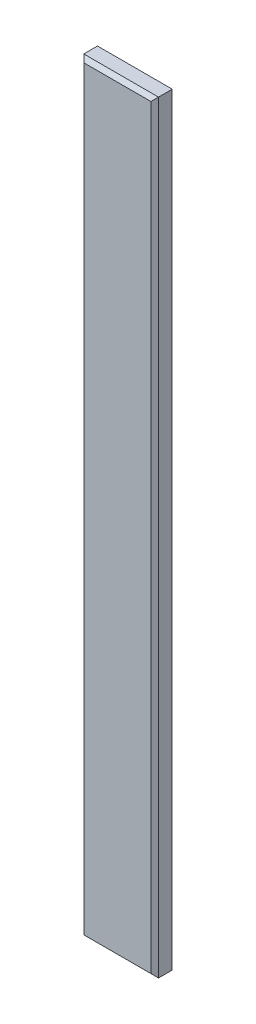
ISO-10303-21;
HEADER;
FILE_DESCRIPTION(('STEP AP214'),'2;1');
FILE_NAME('part.step','',(''),(''),'','','');
FILE_SCHEMA(('AUTOMOTIVE_DESIGN { 1 0 10303 214 1 1 1 1 }'));
ENDSEC;
DATA;
#1=APPLICATION_CONTEXT('core data for automotive mechanical design processes');
#2=APPLICATION_PROTOCOL_DEFINITION('international standard','automotive_design',2000,#1);
#3=PRODUCT_CONTEXT('',#1,'mechanical');
#4=PRODUCT('Part','Part','',(#3));
#5=PRODUCT_RELATED_PRODUCT_CATEGORY('part','',(#4));
#6=PRODUCT_DEFINITION_FORMATION('','',#4);
#7=PRODUCT_DEFINITION_CONTEXT('part definition',#1,'design');
#8=PRODUCT_DEFINITION('design','',#6,#7);
#9=PRODUCT_DEFINITION_SHAPE('','',#8);
#10=(LENGTH_UNIT() NAMED_UNIT(*) SI_UNIT(.MILLI.,.METRE.));
#11=(NAMED_UNIT(*) PLANE_ANGLE_UNIT() SI_UNIT($,.RADIAN.));
#12=(NAMED_UNIT(*) SI_UNIT($,.STERADIAN.) SOLID_ANGLE_UNIT());
#13=UNCERTAINTY_MEASURE_WITH_UNIT(LENGTH_MEASURE(1.E-05),#10,'distance_accuracy_value','');
#14=(GEOMETRIC_REPRESENTATION_CONTEXT(3) GLOBAL_UNCERTAINTY_ASSIGNED_CONTEXT((#13)) GLOBAL_UNIT_ASSIGNED_CONTEXT((#10,
#11,#12)) REPRESENTATION_CONTEXT('',''));
#15=CARTESIAN_POINT('',(0.,0.,0.));
#16=DIRECTION('',(0.,0.,1.));
#17=DIRECTION('',(1.,0.,0.));
#18=AXIS2_PLACEMENT_3D('',#15,#16,#17);
#19=CARTESIAN_POINT('',(4.9,100.,-1.4));
#20=DIRECTION('',(-1.,0.,0.));
#21=DIRECTION('',(0.,0.,1.));
#22=AXIS2_PLACEMENT_3D('',#19,#20,#21);
#23=PLANE('',#22);
#24=DIRECTION('',(0.,0.,-1.));
#25=VECTOR('',#24,1.);
#26=CARTESIAN_POINT('',(4.9,100.,-1.4));
#27=LINE('',#26,#25);
#28=CARTESIAN_POINT('',(4.9,100.,0.9));
#29=VERTEX_POINT('',#28);
#30=CARTESIAN_POINT('',(4.9,100.,-0.899999999999999));
#31=VERTEX_POINT('',#30);
#32=EDGE_CURVE('E183',#29,#31,#27,.T.);
#33=ORIENTED_EDGE('',*,*,#32,.F.);
#34=DIRECTION('',(0.,-1.,0.));
#35=VECTOR('',#34,1.);
#36=CARTESIAN_POINT('',(4.9,100.,0.9));
#37=LINE('',#36,#35);
#38=CARTESIAN_POINT('',(4.9,0.,0.9));
#39=VERTEX_POINT('',#38);
#40=EDGE_CURVE('E141',#29,#39,#37,.T.);
#41=ORIENTED_EDGE('',*,*,#40,.T.);
#42=DIRECTION('',(0.,0.,-1.));
#43=VECTOR('',#42,1.);
#44=CARTESIAN_POINT('',(4.9,0.,-1.4));
#45=LINE('',#44,#43);
#46=CARTESIAN_POINT('',(4.9,0.,-0.899999999999999));
#47=VERTEX_POINT('',#46);
#48=EDGE_CURVE('E156',#39,#47,#45,.T.);
#49=ORIENTED_EDGE('',*,*,#48,.T.);
#50=DIRECTION('',(0.,1.,0.));
#51=VECTOR('',#50,1.);
#52=CARTESIAN_POINT('',(4.9,100.,-0.899999999999999));
#53=LINE('',#52,#51);
#54=EDGE_CURVE('E138',#47,#31,#53,.T.);
#55=ORIENTED_EDGE('',*,*,#54,.T.);
#56=EDGE_LOOP('',(#33,#41,#49,#55));
#57=FACE_BOUND('',#56,.T.);
#58=ADVANCED_FACE('F35',(#57),#23,.F.);
#59=CARTESIAN_POINT('',(-4.9,100.,-1.4));
#60=DIRECTION('',(0.,0.,1.));
#61=DIRECTION('',(1.,0.,0.));
#62=AXIS2_PLACEMENT_3D('',#59,#60,#61);
#63=PLANE('',#62);
#64=DIRECTION('',(1.,0.,0.));
#65=VECTOR('',#64,1.);
#66=CARTESIAN_POINT('',(4.9,99.5,-1.4));
#67=LINE('',#66,#65);
#68=CARTESIAN_POINT('',(-4.40000000000001,99.5,-1.4));
#69=VERTEX_POINT('',#68);
#70=CARTESIAN_POINT('',(4.40000000000002,99.5,-1.4));
#71=VERTEX_POINT('',#70);
#72=EDGE_CURVE('E45',#69,#71,#67,.T.);
#73=ORIENTED_EDGE('',*,*,#72,.T.);
#74=DIRECTION('',(0.,-1.,0.));
#75=VECTOR('',#74,1.);
#76=CARTESIAN_POINT('',(4.40000000000002,100.,-1.4));
#77=LINE('',#76,#75);
#78=CARTESIAN_POINT('',(4.40000000000002,0.499999999999987,-1.4));
#79=VERTEX_POINT('',#78);
#80=EDGE_CURVE('E11',#71,#79,#77,.T.);
#81=ORIENTED_EDGE('',*,*,#80,.T.);
#82=DIRECTION('',(-1.,0.,0.));
#83=VECTOR('',#82,1.);
#84=CARTESIAN_POINT('',(-4.9,0.499999999999987,-1.4));
#85=LINE('',#84,#83);
#86=CARTESIAN_POINT('',(-4.40000000000001,0.499999999999987,-1.4));
#87=VERTEX_POINT('',#86);
#88=EDGE_CURVE('E147',#79,#87,#85,.T.);
#89=ORIENTED_EDGE('',*,*,#88,.T.);
#90=DIRECTION('',(0.,1.,0.));
#91=VECTOR('',#90,1.);
#92=CARTESIAN_POINT('',(-4.40000000000001,100.,-1.4));
#93=LINE('',#92,#91);
#94=EDGE_CURVE('E56',#87,#69,#93,.T.);
#95=ORIENTED_EDGE('',*,*,#94,.T.);
#96=EDGE_LOOP('',(#73,#81,#89,#95));
#97=FACE_BOUND('',#96,.T.);
#98=ADVANCED_FACE('F206',(#97),#63,.F.);
#99=CARTESIAN_POINT('',(-4.9,100.,-1.4));
#100=DIRECTION('',(1.,0.,0.));
#101=DIRECTION('',(0.,0.,-1.));
#102=AXIS2_PLACEMENT_3D('',#99,#100,#101);
#103=PLANE('',#102);
#104=DIRECTION('',(0.,0.,1.));
#105=VECTOR('',#104,1.);
#106=CARTESIAN_POINT('',(-4.9,0.,-1.4));
#107=LINE('',#106,#105);
#108=CARTESIAN_POINT('',(-4.9,0.,-0.899999999999999));
#109=VERTEX_POINT('',#108);
#110=CARTESIAN_POINT('',(-4.9,0.,0.9));
#111=VERTEX_POINT('',#110);
#112=EDGE_CURVE('E177',#109,#111,#107,.T.);
#113=ORIENTED_EDGE('',*,*,#112,.T.);
#114=DIRECTION('',(0.,1.,0.));
#115=VECTOR('',#114,1.);
#116=CARTESIAN_POINT('',(-4.9,100.,0.9));
#117=LINE('',#116,#115);
#118=CARTESIAN_POINT('',(-4.9,100.,0.9));
#119=VERTEX_POINT('',#118);
#120=EDGE_CURVE('E108',#111,#119,#117,.T.);
#121=ORIENTED_EDGE('',*,*,#120,.T.);
#122=DIRECTION('',(0.,0.,1.));
#123=VECTOR('',#122,1.);
#124=CARTESIAN_POINT('',(-4.9,100.,-1.4));
#125=LINE('',#124,#123);
#126=CARTESIAN_POINT('',(-4.9,100.,-0.899999999999999));
#127=VERTEX_POINT('',#126);
#128=EDGE_CURVE('E121',#127,#119,#125,.T.);
#129=ORIENTED_EDGE('',*,*,#128,.F.);
#130=DIRECTION('',(0.,-1.,0.));
#131=VECTOR('',#130,1.);
#132=CARTESIAN_POINT('',(-4.9,100.,-0.899999999999999));
#133=LINE('',#132,#131);
#134=EDGE_CURVE('E127',#127,#109,#133,.T.);
#135=ORIENTED_EDGE('',*,*,#134,.T.);
#136=EDGE_LOOP('',(#113,#121,#129,#135));
#137=FACE_BOUND('',#136,.T.);
#138=ADVANCED_FACE('F176',(#137),#103,.F.);
#139=CARTESIAN_POINT('',(-4.9,100.,1.4));
#140=DIRECTION('',(0.,0.,-1.));
#141=DIRECTION('',(-1.,0.,0.));
#142=AXIS2_PLACEMENT_3D('',#139,#140,#141);
#143=PLANE('',#142);
#144=DIRECTION('',(-1.,0.,0.));
#145=VECTOR('',#144,1.);
#146=CARTESIAN_POINT('',(-4.9,99.5,1.4));
#147=LINE('',#146,#145);
#148=CARTESIAN_POINT('',(4.40000000000002,99.5,1.4));
#149=VERTEX_POINT('',#148);
#150=CARTESIAN_POINT('',(-4.40000000000001,99.5,1.4));
#151=VERTEX_POINT('',#150);
#152=EDGE_CURVE('E125',#149,#151,#147,.T.);
#153=ORIENTED_EDGE('',*,*,#152,.T.);
#154=DIRECTION('',(0.,-1.,0.));
#155=VECTOR('',#154,1.);
#156=CARTESIAN_POINT('',(-4.40000000000001,100.,1.4));
#157=LINE('',#156,#155);
#158=CARTESIAN_POINT('',(-4.40000000000001,0.499999999999987,1.4));
#159=VERTEX_POINT('',#158);
#160=EDGE_CURVE('E106',#151,#159,#157,.T.);
#161=ORIENTED_EDGE('',*,*,#160,.T.);
#162=DIRECTION('',(1.,0.,0.));
#163=VECTOR('',#162,1.);
#164=CARTESIAN_POINT('',(-4.9,0.499999999999987,1.4));
#165=LINE('',#164,#163);
#166=CARTESIAN_POINT('',(4.40000000000002,0.499999999999987,1.4));
#167=VERTEX_POINT('',#166);
#168=EDGE_CURVE('E114',#159,#167,#165,.T.);
#169=ORIENTED_EDGE('',*,*,#168,.T.);
#170=DIRECTION('',(0.,1.,0.));
#171=VECTOR('',#170,1.);
#172=CARTESIAN_POINT('',(4.40000000000002,100.,1.4));
#173=LINE('',#172,#171);
#174=EDGE_CURVE('E120',#167,#149,#173,.T.);
#175=ORIENTED_EDGE('',*,*,#174,.T.);
#176=EDGE_LOOP('',(#153,#161,#169,#175));
#177=FACE_BOUND('',#176,.T.);
#178=ADVANCED_FACE('F123',(#177),#143,.F.);
#179=CARTESIAN_POINT('',(0.,100.,0.));
#180=DIRECTION('',(0.,1.,0.));
#181=DIRECTION('',(0.,0.,1.));
#182=AXIS2_PLACEMENT_3D('',#179,#180,#181);
#183=PLANE('',#182);
#184=ORIENTED_EDGE('',*,*,#128,.T.);
#185=DIRECTION('',(1.,0.,0.));
#186=VECTOR('',#185,1.);
#187=CARTESIAN_POINT('',(4.9,100.,0.9));
#188=LINE('',#187,#186);
#189=EDGE_CURVE('E136',#119,#29,#188,.T.);
#190=ORIENTED_EDGE('',*,*,#189,.T.);
#191=ORIENTED_EDGE('',*,*,#32,.T.);
#192=DIRECTION('',(-1.,0.,0.));
#193=VECTOR('',#192,1.);
#194=CARTESIAN_POINT('',(-4.9,100.,-0.899999999999999));
#195=LINE('',#194,#193);
#196=EDGE_CURVE('E134',#31,#127,#195,.T.);
#197=ORIENTED_EDGE('',*,*,#196,.T.);
#198=EDGE_LOOP('',(#184,#190,#191,#197));
#199=FACE_BOUND('',#198,.T.);
#200=ADVANCED_FACE('F198',(#199),#183,.T.);
#201=CARTESIAN_POINT('',(0.,0.,0.));
#202=DIRECTION('',(0.,1.,0.));
#203=DIRECTION('',(0.,0.,1.));
#204=AXIS2_PLACEMENT_3D('',#201,#202,#203);
#205=PLANE('',#204);
#206=ORIENTED_EDGE('',*,*,#48,.F.);
#207=DIRECTION('',(-1.,0.,0.));
#208=VECTOR('',#207,1.);
#209=CARTESIAN_POINT('',(0.,0.,0.9));
#210=LINE('',#209,#208);
#211=EDGE_CURVE('E145',#39,#111,#210,.T.);
#212=ORIENTED_EDGE('',*,*,#211,.T.);
#213=ORIENTED_EDGE('',*,*,#112,.F.);
#214=DIRECTION('',(1.,0.,0.));
#215=VECTOR('',#214,1.);
#216=CARTESIAN_POINT('',(0.,0.,-0.899999999999999));
#217=LINE('',#216,#215);
#218=EDGE_CURVE('E143',#109,#47,#217,.T.);
#219=ORIENTED_EDGE('',*,*,#218,.T.);
#220=EDGE_LOOP('',(#206,#212,#213,#219));
#221=FACE_BOUND('',#220,.T.);
#222=ADVANCED_FACE('F181',(#221),#205,.F.);
#223=CARTESIAN_POINT('',(4.9,100.,0.9));
#224=DIRECTION('',(-0.707106781186557,0.,-0.707106781186538));
#225=DIRECTION('',(0.,-1.,0.));
#226=AXIS2_PLACEMENT_3D('',#223,#224,#225);
#227=PLANE('',#226);
#228=DIRECTION('',(-0.57735026918962,0.57735026918962,0.577350269189636));
#229=VECTOR('',#228,1.);
#230=CARTESIAN_POINT('',(1.30000000000007,3.59999999999993,4.50000000000003));
#231=LINE('',#230,#229);
#232=EDGE_CURVE('E117',#39,#167,#231,.T.);
#233=ORIENTED_EDGE('',*,*,#232,.F.);
#234=ORIENTED_EDGE('',*,*,#40,.F.);
#235=DIRECTION('',(0.57735026918962,0.57735026918962,-0.577350269189636));
#236=VECTOR('',#235,1.);
#237=CARTESIAN_POINT('',(4.9,100.,0.9));
#238=LINE('',#237,#236);
#239=EDGE_CURVE('E153',#149,#29,#238,.T.);
#240=ORIENTED_EDGE('',*,*,#239,.F.);
#241=ORIENTED_EDGE('',*,*,#174,.F.);
#242=EDGE_LOOP('',(#233,#234,#240,#241));
#243=FACE_BOUND('',#242,.T.);
#244=ADVANCED_FACE('F192',(#243),#227,.F.);
#245=CARTESIAN_POINT('',(0.,100.,0.9));
#246=DIRECTION('',(0.,0.707106781186557,0.707106781186538));
#247=DIRECTION('',(-1.,0.,0.));
#248=AXIS2_PLACEMENT_3D('',#245,#246,#247);
#249=PLANE('',#248);
#250=ORIENTED_EDGE('',*,*,#239,.T.);
#251=ORIENTED_EDGE('',*,*,#189,.F.);
#252=DIRECTION('',(-0.57735026918962,0.57735026918962,-0.577350269189636));
#253=VECTOR('',#252,1.);
#254=CARTESIAN_POINT('',(-3.2666666666667,98.3666666666667,2.53333333333335));
#255=LINE('',#254,#253);
#256=EDGE_CURVE('E111',#151,#119,#255,.T.);
#257=ORIENTED_EDGE('',*,*,#256,.F.);
#258=ORIENTED_EDGE('',*,*,#152,.F.);
#259=EDGE_LOOP('',(#250,#251,#257,#258));
#260=FACE_BOUND('',#259,.T.);
#261=ADVANCED_FACE('F195',(#260),#249,.T.);
#262=CARTESIAN_POINT('',(-4.9,0.499999999999987,1.4));
#263=DIRECTION('',(0.,0.707106781186557,-0.707106781186538));
#264=DIRECTION('',(1.,0.,0.));
#265=AXIS2_PLACEMENT_3D('',#262,#263,#264);
#266=PLANE('',#265);
#267=ORIENTED_EDGE('',*,*,#232,.T.);
#268=ORIENTED_EDGE('',*,*,#168,.F.);
#269=DIRECTION('',(-0.57735026918962,-0.57735026918962,-0.577350269189636));
#270=VECTOR('',#269,1.);
#271=CARTESIAN_POINT('',(-4.56666666666667,0.333333333333328,1.23333333333334));
#272=LINE('',#271,#270);
#273=EDGE_CURVE('E102',#111,#159,#272,.F.);
#274=ORIENTED_EDGE('',*,*,#273,.F.);
#275=ORIENTED_EDGE('',*,*,#211,.F.);
#276=EDGE_LOOP('',(#267,#268,#274,#275));
#277=FACE_BOUND('',#276,.T.);
#278=ADVANCED_FACE('F115',(#277),#266,.F.);
#279=CARTESIAN_POINT('',(-4.40000000000001,100.,1.4));
#280=DIRECTION('',(0.707106781186557,0.,-0.707106781186538));
#281=DIRECTION('',(0.,-1.,0.));
#282=AXIS2_PLACEMENT_3D('',#279,#280,#281);
#283=PLANE('',#282);
#284=ORIENTED_EDGE('',*,*,#256,.T.);
#285=ORIENTED_EDGE('',*,*,#120,.F.);
#286=ORIENTED_EDGE('',*,*,#273,.T.);
#287=ORIENTED_EDGE('',*,*,#160,.F.);
#288=EDGE_LOOP('',(#284,#285,#286,#287));
#289=FACE_BOUND('',#288,.T.);
#290=ADVANCED_FACE('F104',(#289),#283,.F.);
#291=CARTESIAN_POINT('',(-4.9,100.,-0.899999999999999));
#292=DIRECTION('',(0.707106781186557,0.,0.707106781186538));
#293=DIRECTION('',(0.,-1.,0.));
#294=AXIS2_PLACEMENT_3D('',#291,#292,#293);
#295=PLANE('',#294);
#296=DIRECTION('',(0.57735026918962,0.57735026918962,-0.577350269189636));
#297=VECTOR('',#296,1.);
#298=CARTESIAN_POINT('',(-4.56666666666667,0.333333333333327,-1.23333333333334));
#299=LINE('',#298,#297);
#300=EDGE_CURVE('E160',#109,#87,#299,.T.);
#301=ORIENTED_EDGE('',*,*,#300,.F.);
#302=ORIENTED_EDGE('',*,*,#134,.F.);
#303=DIRECTION('',(-0.57735026918962,0.57735026918962,0.577350269189636));
#304=VECTOR('',#303,1.);
#305=CARTESIAN_POINT('',(-4.9,100.,-0.899999999999999));
#306=LINE('',#305,#304);
#307=EDGE_CURVE('E40',#69,#127,#306,.T.);
#308=ORIENTED_EDGE('',*,*,#307,.F.);
#309=ORIENTED_EDGE('',*,*,#94,.F.);
#310=EDGE_LOOP('',(#301,#302,#308,#309));
#311=FACE_BOUND('',#310,.T.);
#312=ADVANCED_FACE('F38',(#311),#295,.F.);
#313=CARTESIAN_POINT('',(0.,100.,-0.899999999999999));
#314=DIRECTION('',(0.,0.707106781186557,-0.707106781186538));
#315=DIRECTION('',(1.,0.,0.));
#316=AXIS2_PLACEMENT_3D('',#313,#314,#315);
#317=PLANE('',#316);
#318=ORIENTED_EDGE('',*,*,#307,.T.);
#319=ORIENTED_EDGE('',*,*,#196,.F.);
#320=DIRECTION('',(0.57735026918962,0.57735026918962,0.577350269189636));
#321=VECTOR('',#320,1.);
#322=CARTESIAN_POINT('',(3.2666666666667,98.3666666666667,-2.53333333333335));
#323=LINE('',#322,#321);
#324=EDGE_CURVE('E159',#71,#31,#323,.T.);
#325=ORIENTED_EDGE('',*,*,#324,.F.);
#326=ORIENTED_EDGE('',*,*,#72,.F.);
#327=EDGE_LOOP('',(#318,#319,#325,#326));
#328=FACE_BOUND('',#327,.T.);
#329=ADVANCED_FACE('F169',(#328),#317,.T.);
#330=CARTESIAN_POINT('',(-4.9,0.499999999999987,-1.4));
#331=DIRECTION('',(0.,0.707106781186557,0.707106781186538));
#332=DIRECTION('',(-1.,0.,0.));
#333=AXIS2_PLACEMENT_3D('',#330,#331,#332);
#334=PLANE('',#333);
#335=ORIENTED_EDGE('',*,*,#300,.T.);
#336=ORIENTED_EDGE('',*,*,#88,.F.);
#337=DIRECTION('',(0.57735026918962,-0.57735026918962,0.577350269189636));
#338=VECTOR('',#337,1.);
#339=CARTESIAN_POINT('',(1.30000000000007,3.59999999999993,-4.50000000000003));
#340=LINE('',#339,#338);
#341=EDGE_CURVE('E157',#47,#79,#340,.F.);
#342=ORIENTED_EDGE('',*,*,#341,.F.);
#343=ORIENTED_EDGE('',*,*,#218,.F.);
#344=EDGE_LOOP('',(#335,#336,#342,#343));
#345=FACE_BOUND('',#344,.T.);
#346=ADVANCED_FACE('F205',(#345),#334,.F.);
#347=CARTESIAN_POINT('',(4.40000000000002,100.,-1.4));
#348=DIRECTION('',(-0.707106781186557,0.,0.707106781186538));
#349=DIRECTION('',(0.,-1.,0.));
#350=AXIS2_PLACEMENT_3D('',#347,#348,#349);
#351=PLANE('',#350);
#352=ORIENTED_EDGE('',*,*,#324,.T.);
#353=ORIENTED_EDGE('',*,*,#54,.F.);
#354=ORIENTED_EDGE('',*,*,#341,.T.);
#355=ORIENTED_EDGE('',*,*,#80,.F.);
#356=EDGE_LOOP('',(#352,#353,#354,#355));
#357=FACE_BOUND('',#356,.T.);
#358=ADVANCED_FACE('F203',(#357),#351,.F.);
#359=CLOSED_SHELL('',(#58,#98,#138,#178,#200,#222,#244,#261,#278,#290,#312,#329,#346,#358));
#360=MANIFOLD_SOLID_BREP('B2',#359);
#361=ADVANCED_BREP_SHAPE_REPRESENTATION('',(#18,#360),#14);
#362=SHAPE_DEFINITION_REPRESENTATION(#9,#361);
ENDSEC;
END-ISO-10303-21;
